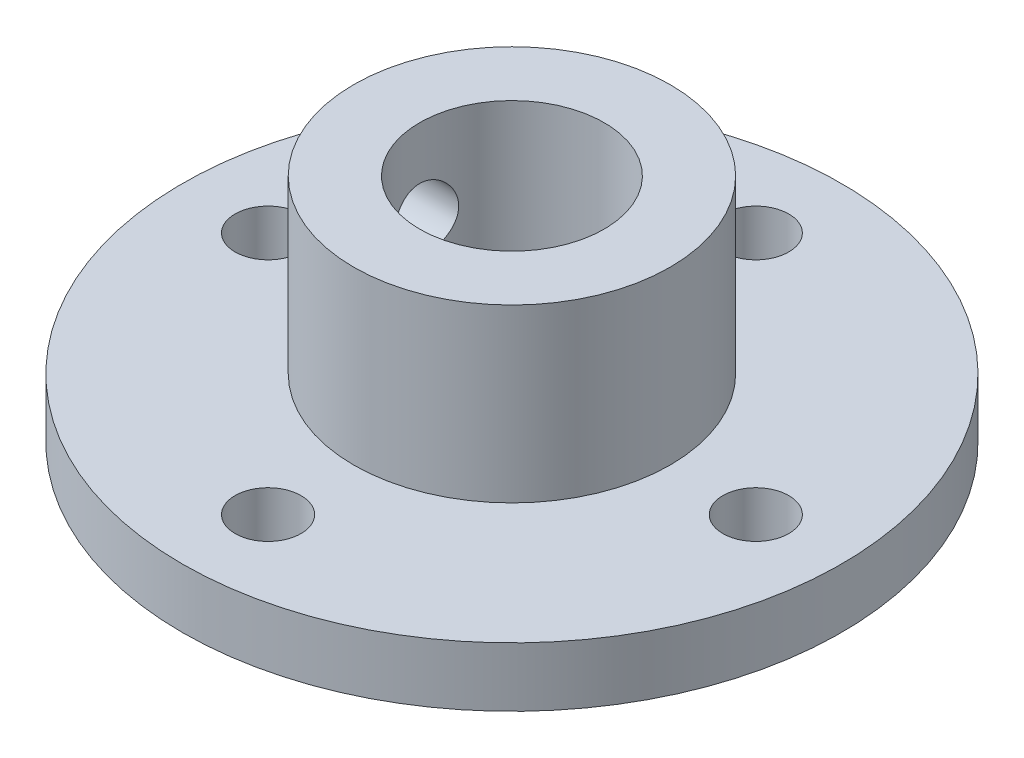
ISO-10303-21;
HEADER;
FILE_DESCRIPTION(('STEP AP214'),'2;1');
FILE_NAME('part.step','',(''),(''),'','','');
FILE_SCHEMA(('AUTOMOTIVE_DESIGN { 1 0 10303 214 1 1 1 1 }'));
ENDSEC;
DATA;
#1=APPLICATION_CONTEXT('core data for automotive mechanical design processes');
#2=APPLICATION_PROTOCOL_DEFINITION('international standard','automotive_design',2000,#1);
#3=PRODUCT_CONTEXT('',#1,'mechanical');
#4=PRODUCT('Part','Part','',(#3));
#5=PRODUCT_RELATED_PRODUCT_CATEGORY('part','',(#4));
#6=PRODUCT_DEFINITION_FORMATION('','',#4);
#7=PRODUCT_DEFINITION_CONTEXT('part definition',#1,'design');
#8=PRODUCT_DEFINITION('design','',#6,#7);
#9=PRODUCT_DEFINITION_SHAPE('','',#8);
#10=(LENGTH_UNIT() NAMED_UNIT(*) SI_UNIT(.MILLI.,.METRE.));
#11=(NAMED_UNIT(*) PLANE_ANGLE_UNIT() SI_UNIT($,.RADIAN.));
#12=(NAMED_UNIT(*) SI_UNIT($,.STERADIAN.) SOLID_ANGLE_UNIT());
#13=UNCERTAINTY_MEASURE_WITH_UNIT(LENGTH_MEASURE(1.E-05),#10,'distance_accuracy_value','');
#14=(GEOMETRIC_REPRESENTATION_CONTEXT(3) GLOBAL_UNCERTAINTY_ASSIGNED_CONTEXT((#13)) GLOBAL_UNIT_ASSIGNED_CONTEXT((#10,
#11,#12)) REPRESENTATION_CONTEXT('',''));
#15=CARTESIAN_POINT('',(0.,0.,0.));
#16=DIRECTION('',(0.,0.,1.));
#17=DIRECTION('',(1.,0.,0.));
#18=AXIS2_PLACEMENT_3D('',#15,#16,#17);
#19=CARTESIAN_POINT('',(0.,4.5,0.));
#20=DIRECTION('',(0.,-1.,0.));
#21=DIRECTION('',(0.,0.,-1.));
#22=AXIS2_PLACEMENT_3D('',#19,#20,#21);
#23=CYLINDRICAL_SURFACE('',#22,25.);
#24=CARTESIAN_POINT('',(0.,4.5,0.));
#25=DIRECTION('',(0.,1.,0.));
#26=DIRECTION('',(0.,0.,1.));
#27=AXIS2_PLACEMENT_3D('',#24,#25,#26);
#28=CIRCLE('',#27,25.);
#29=CARTESIAN_POINT('',(0.,4.5,25.));
#30=VERTEX_POINT('',#29);
#31=EDGE_CURVE('E49',#30,#30,#28,.T.);
#32=ORIENTED_EDGE('',*,*,#31,.F.);
#33=EDGE_LOOP('',(#32));
#34=FACE_BOUND('',#33,.T.);
#35=CARTESIAN_POINT('',(0.,0.,0.));
#36=DIRECTION('',(0.,1.,0.));
#37=DIRECTION('',(0.,0.,1.));
#38=AXIS2_PLACEMENT_3D('',#35,#36,#37);
#39=CIRCLE('',#38,25.);
#40=CARTESIAN_POINT('',(0.,0.,25.));
#41=VERTEX_POINT('',#40);
#42=EDGE_CURVE('E54',#41,#41,#39,.T.);
#43=ORIENTED_EDGE('',*,*,#42,.T.);
#44=EDGE_LOOP('',(#43));
#45=FACE_BOUND('',#44,.T.);
#46=ADVANCED_FACE('F37',(#34,#45),#23,.T.);
#47=CARTESIAN_POINT('',(0.,4.5,0.));
#48=DIRECTION('',(0.,1.,0.));
#49=DIRECTION('',(0.,0.,1.));
#50=AXIS2_PLACEMENT_3D('',#47,#48,#49);
#51=PLANE('',#50);
#52=CARTESIAN_POINT('',(-18.5,4.5,0.));
#53=DIRECTION('',(0.,1.,0.));
#54=DIRECTION('',(0.,0.,1.));
#55=AXIS2_PLACEMENT_3D('',#52,#53,#54);
#56=CIRCLE('',#55,2.5);
#57=CARTESIAN_POINT('',(-18.5,4.5,2.5));
#58=VERTEX_POINT('',#57);
#59=EDGE_CURVE('E91',#58,#58,#56,.T.);
#60=ORIENTED_EDGE('',*,*,#59,.F.);
#61=EDGE_LOOP('',(#60));
#62=FACE_BOUND('',#61,.T.);
#63=CARTESIAN_POINT('',(0.,4.5,-18.5));
#64=DIRECTION('',(0.,1.,0.));
#65=DIRECTION('',(0.,0.,1.));
#66=AXIS2_PLACEMENT_3D('',#63,#64,#65);
#67=CIRCLE('',#66,2.5);
#68=CARTESIAN_POINT('',(0.,4.5,-16.));
#69=VERTEX_POINT('',#68);
#70=EDGE_CURVE('E88',#69,#69,#67,.T.);
#71=ORIENTED_EDGE('',*,*,#70,.F.);
#72=EDGE_LOOP('',(#71));
#73=FACE_BOUND('',#72,.T.);
#74=CARTESIAN_POINT('',(18.5,4.5,0.));
#75=DIRECTION('',(0.,1.,0.));
#76=DIRECTION('',(0.,0.,1.));
#77=AXIS2_PLACEMENT_3D('',#74,#75,#76);
#78=CIRCLE('',#77,2.5);
#79=CARTESIAN_POINT('',(18.5,4.5,2.5));
#80=VERTEX_POINT('',#79);
#81=EDGE_CURVE('E82',#80,#80,#78,.T.);
#82=ORIENTED_EDGE('',*,*,#81,.F.);
#83=EDGE_LOOP('',(#82));
#84=FACE_BOUND('',#83,.T.);
#85=CARTESIAN_POINT('',(0.,4.5,18.5));
#86=DIRECTION('',(0.,1.,0.));
#87=DIRECTION('',(0.,0.,1.));
#88=AXIS2_PLACEMENT_3D('',#85,#86,#87);
#89=CIRCLE('',#88,2.5);
#90=CARTESIAN_POINT('',(0.,4.5,21.));
#91=VERTEX_POINT('',#90);
#92=EDGE_CURVE('E74',#91,#91,#89,.T.);
#93=ORIENTED_EDGE('',*,*,#92,.F.);
#94=EDGE_LOOP('',(#93));
#95=FACE_BOUND('',#94,.T.);
#96=CARTESIAN_POINT('',(0.,4.5,0.));
#97=DIRECTION('',(0.,1.,0.));
#98=DIRECTION('',(0.,0.,1.));
#99=AXIS2_PLACEMENT_3D('',#96,#97,#98);
#100=CIRCLE('',#99,12.);
#101=CARTESIAN_POINT('',(0.,4.5,12.));
#102=VERTEX_POINT('',#101);
#103=EDGE_CURVE('E10',#102,#102,#100,.T.);
#104=ORIENTED_EDGE('',*,*,#103,.F.);
#105=EDGE_LOOP('',(#104));
#106=FACE_BOUND('',#105,.T.);
#107=ORIENTED_EDGE('',*,*,#31,.T.);
#108=EDGE_LOOP('',(#107));
#109=FACE_BOUND('',#108,.T.);
#110=ADVANCED_FACE('F143',(#62,#73,#84,#95,#106,#109),#51,.T.);
#111=CARTESIAN_POINT('',(0.,0.,0.));
#112=DIRECTION('',(0.,1.,0.));
#113=DIRECTION('',(0.,0.,1.));
#114=AXIS2_PLACEMENT_3D('',#111,#112,#113);
#115=PLANE('',#114);
#116=CARTESIAN_POINT('',(-18.5,0.,0.));
#117=DIRECTION('',(0.,1.,0.));
#118=DIRECTION('',(0.,0.,1.));
#119=AXIS2_PLACEMENT_3D('',#116,#117,#118);
#120=CIRCLE('',#119,2.5);
#121=CARTESIAN_POINT('',(-18.5,0.,2.5));
#122=VERTEX_POINT('',#121);
#123=EDGE_CURVE('E71',#122,#122,#120,.F.);
#124=ORIENTED_EDGE('',*,*,#123,.F.);
#125=EDGE_LOOP('',(#124));
#126=FACE_BOUND('',#125,.T.);
#127=CARTESIAN_POINT('',(0.,0.,-18.5));
#128=DIRECTION('',(0.,1.,0.));
#129=DIRECTION('',(0.,0.,1.));
#130=AXIS2_PLACEMENT_3D('',#127,#128,#129);
#131=CIRCLE('',#130,2.5);
#132=CARTESIAN_POINT('',(0.,0.,-16.));
#133=VERTEX_POINT('',#132);
#134=EDGE_CURVE('E85',#133,#133,#131,.F.);
#135=ORIENTED_EDGE('',*,*,#134,.F.);
#136=EDGE_LOOP('',(#135));
#137=FACE_BOUND('',#136,.T.);
#138=CARTESIAN_POINT('',(18.5,0.,0.));
#139=DIRECTION('',(0.,1.,0.));
#140=DIRECTION('',(0.,0.,1.));
#141=AXIS2_PLACEMENT_3D('',#138,#139,#140);
#142=CIRCLE('',#141,2.5);
#143=CARTESIAN_POINT('',(18.5,0.,2.5));
#144=VERTEX_POINT('',#143);
#145=EDGE_CURVE('E77',#144,#144,#142,.F.);
#146=ORIENTED_EDGE('',*,*,#145,.F.);
#147=EDGE_LOOP('',(#146));
#148=FACE_BOUND('',#147,.T.);
#149=CARTESIAN_POINT('',(0.,0.,18.5));
#150=DIRECTION('',(0.,1.,0.));
#151=DIRECTION('',(0.,0.,1.));
#152=AXIS2_PLACEMENT_3D('',#149,#150,#151);
#153=CIRCLE('',#152,2.5);
#154=CARTESIAN_POINT('',(0.,0.,21.));
#155=VERTEX_POINT('',#154);
#156=EDGE_CURVE('E78',#155,#155,#153,.F.);
#157=ORIENTED_EDGE('',*,*,#156,.F.);
#158=EDGE_LOOP('',(#157));
#159=FACE_BOUND('',#158,.T.);
#160=CARTESIAN_POINT('',(0.,0.,0.));
#161=DIRECTION('',(0.,1.,0.));
#162=DIRECTION('',(0.,0.,1.));
#163=AXIS2_PLACEMENT_3D('',#160,#161,#162);
#164=CIRCLE('',#163,7.);
#165=CARTESIAN_POINT('',(0.,0.,7.));
#166=VERTEX_POINT('',#165);
#167=EDGE_CURVE('E63',#166,#166,#164,.F.);
#168=ORIENTED_EDGE('',*,*,#167,.F.);
#169=EDGE_LOOP('',(#168));
#170=FACE_BOUND('',#169,.T.);
#171=ORIENTED_EDGE('',*,*,#42,.F.);
#172=EDGE_LOOP('',(#171));
#173=FACE_BOUND('',#172,.T.);
#174=ADVANCED_FACE('F140',(#126,#137,#148,#159,#170,#173),#115,.F.);
#175=CARTESIAN_POINT('',(0.,17.5,0.));
#176=DIRECTION('',(0.,-1.,0.));
#177=DIRECTION('',(0.,0.,-1.));
#178=AXIS2_PLACEMENT_3D('',#175,#176,#177);
#179=CYLINDRICAL_SURFACE('',#178,12.);
#180=CARTESIAN_POINT('',(-11.7366945943055,11.,-2.5));
#181=CARTESIAN_POINT('',(-11.7366973843002,11.1387812303038,-2.499995017553));
#182=CARTESIAN_POINT('',(-11.7391829184982,11.2776239440309,-2.48840458867923));
#183=CARTESIAN_POINT('',(-11.7488403116286,11.551372634634,-2.44239298467531));
#184=CARTESIAN_POINT('',(-11.7560157627658,11.6862755110127,-2.40795430880677));
#185=CARTESIAN_POINT('',(-11.7742058592406,11.9481447456699,-2.31736795014468));
#186=CARTESIAN_POINT('',(-11.7852165141394,12.0751191919836,-2.26124282497867));
#187=CARTESIAN_POINT('',(-11.8098316267143,12.3178489992912,-2.12893977203463));
#188=CARTESIAN_POINT('',(-11.8234359795523,12.43360481346,-2.05276265471639));
#189=CARTESIAN_POINT('',(-11.8519386932295,12.6523907503069,-1.88127279893217));
#190=CARTESIAN_POINT('',(-11.8668522874608,12.7552237872529,-1.78571110973934));
#191=CARTESIAN_POINT('',(-11.8961593360515,12.9435221372962,-1.57870244776128));
#192=CARTESIAN_POINT('',(-11.9105527521983,13.0289861765829,-1.46725431091201));
#193=CARTESIAN_POINT('',(-11.937362702377,13.1808917761657,-1.23032410599918));
#194=CARTESIAN_POINT('',(-11.9497591726249,13.2471450529265,-1.10471885640989));
#195=CARTESIAN_POINT('',(-11.971006946866,13.3575321057196,-0.843857102013443));
#196=CARTESIAN_POINT('',(-11.9798586112245,13.4016681303071,-0.708601579901185));
#197=CARTESIAN_POINT('',(-11.9929117978436,13.4659515222349,-0.434325808401007));
#198=CARTESIAN_POINT('',(-11.9971778391985,13.4864320343903,-0.295386761832718));
#199=CARTESIAN_POINT('',(-12.0008022516122,13.503863391514,-0.0159836976790511));
#200=CARTESIAN_POINT('',(-12.0001611340738,13.5008166883862,0.124480159473675));
#201=CARTESIAN_POINT('',(-11.9940931618102,13.4715307980865,0.400653172399142));
#202=CARTESIAN_POINT('',(-11.9887403791317,13.4456505620838,0.536402257452949));
#203=CARTESIAN_POINT('',(-11.9739344179777,13.3720027493374,0.801587492579503));
#204=CARTESIAN_POINT('',(-11.9644810658381,13.3242342455938,0.931023375022042));
#205=CARTESIAN_POINT('',(-11.9424153464785,13.207839895749,1.18092001076937));
#206=CARTESIAN_POINT('',(-11.9297820825069,13.1390754115807,1.3013142699633));
#207=CARTESIAN_POINT('',(-11.9027460088038,12.9827439943192,1.5289869130213));
#208=CARTESIAN_POINT('',(-11.8883429791665,12.8951747235877,1.63626366363284));
#209=CARTESIAN_POINT('',(-11.8590340046655,12.7017567502179,1.83678840655382));
#210=CARTESIAN_POINT('',(-11.8441236995185,12.5955938800361,1.92973297498959));
#211=CARTESIAN_POINT('',(-11.8157374529799,12.3690359020104,2.09655194480976));
#212=CARTESIAN_POINT('',(-11.8022615435432,12.2486404772255,2.1704259213996));
#213=CARTESIAN_POINT('',(-11.7782599681831,11.9965754903424,2.29712434276908));
#214=CARTESIAN_POINT('',(-11.7677417046425,11.8648786986131,2.34989610979454));
#215=CARTESIAN_POINT('',(-11.7509521282072,11.5942167612612,2.43247155077345));
#216=CARTESIAN_POINT('',(-11.7446802101436,11.4552526543838,2.46227849764697));
#217=CARTESIAN_POINT('',(-11.7372156647826,11.1767605873622,2.49761727734035));
#218=CARTESIAN_POINT('',(-11.7359310372695,11.0372908309259,2.50358885835997));
#219=CARTESIAN_POINT('',(-11.7383390403741,10.7593483769197,2.49227386878588));
#220=CARTESIAN_POINT('',(-11.7420313630525,10.6208756181953,2.47498873715725));
#221=CARTESIAN_POINT('',(-11.7538907645233,10.3503589678838,2.41803116650967));
#222=CARTESIAN_POINT('',(-11.76201022566,10.2182626656423,2.37859682753743));
#223=CARTESIAN_POINT('',(-11.7817667700624,9.96255202111679,2.27871621721838));
#224=CARTESIAN_POINT('',(-11.7934041638211,9.8389384286992,2.21826809112293));
#225=CARTESIAN_POINT('',(-11.8190900387438,9.60178711756754,2.07709196362969));
#226=CARTESIAN_POINT('',(-11.8331701329665,9.48841559106766,1.99609065470792));
#227=CARTESIAN_POINT('',(-11.8620696798782,9.27671350168988,1.81646888113976));
#228=CARTESIAN_POINT('',(-11.8768892153306,9.17838462752154,1.71784644101035));
#229=CARTESIAN_POINT('',(-11.9058984863347,8.99787457380567,1.50380090168668));
#230=CARTESIAN_POINT('',(-11.9200734943982,8.91599180994723,1.3881238152291));
#231=CARTESIAN_POINT('',(-11.9459341754481,8.77282249582404,1.14440020443272));
#232=CARTESIAN_POINT('',(-11.9576199584164,8.7115350355251,1.01635422695376));
#233=CARTESIAN_POINT('',(-11.9771229654136,8.6117226413653,0.75228423569584));
#234=CARTESIAN_POINT('',(-11.9849632627299,8.57306166891132,0.616313421940393));
#235=CARTESIAN_POINT('',(-11.9959912282046,8.51917119198381,0.339626801006945));
#236=CARTESIAN_POINT('',(-11.9991795068579,8.50393861293454,0.198911618923386));
#237=CARTESIAN_POINT('',(-12.0005281611387,8.49746475590296,-0.0804266869406717));
#238=CARTESIAN_POINT('',(-11.9987822750957,8.5057762000105,-0.219039184355821));
#239=CARTESIAN_POINT('',(-11.99065748189,8.5451612773059,-0.492845740747128));
#240=CARTESIAN_POINT('',(-11.9842786434588,8.57623457281369,-0.62803985040549));
#241=CARTESIAN_POINT('',(-11.9676092015489,8.66005558929697,-0.890863930984022));
#242=CARTESIAN_POINT('',(-11.9573290681437,8.71274532770566,-1.01851310000874));
#243=CARTESIAN_POINT('',(-11.9339599069615,8.83824479546456,-1.2632211344418));
#244=CARTESIAN_POINT('',(-11.9208706346327,8.91105627668834,-1.38027907656019));
#245=CARTESIAN_POINT('',(-11.8930319356995,9.07621933598451,-1.60268064259534));
#246=CARTESIAN_POINT('',(-11.8782576059507,9.1688885761055,-1.70778526722739));
#247=CARTESIAN_POINT('',(-11.8488557363333,9.37048900200207,-1.90110548396524));
#248=CARTESIAN_POINT('',(-11.8342282323044,9.47942405992639,-1.98931704315914));
#249=CARTESIAN_POINT('',(-11.8065838324643,9.71201820484104,-2.14734903704121));
#250=CARTESIAN_POINT('',(-11.7935881325424,9.83583682282062,-2.21693856248136));
#251=CARTESIAN_POINT('',(-11.7709407916825,10.0936503120621,-2.3342125584477));
#252=CARTESIAN_POINT('',(-11.7612862067076,10.2276360968785,-2.381916325835));
#253=CARTESIAN_POINT('',(-11.7482800883641,10.4682125631532,-2.44513108264677));
#254=CARTESIAN_POINT('',(-11.7439632719021,10.5734590731905,-2.46566898011599));
#255=CARTESIAN_POINT('',(-11.7381695052653,10.7857915610376,-2.4931050871655));
#256=CARTESIAN_POINT('',(-11.7366924407628,10.8928774646188,-2.50000384585405));
#257=CARTESIAN_POINT('',(-11.7366945943055,11.,-2.5));
#258=B_SPLINE_CURVE_WITH_KNOTS('',3,(#180,#181,#182,#183,#184,#185,#186,#187,#188,#189,#190,
#191,#192,#193,#194,#195,#196,#197,#198,#199,#200,#201,#202,#203,#204,#205,#206,#207,#208,#209,
#210,#211,#212,#213,#214,#215,#216,#217,#218,#219,#220,#221,#222,#223,#224,#225,#226,#227,#228,
#229,#230,#231,#232,#233,#234,#235,#236,#237,#238,#239,#240,#241,#242,#243,#244,#245,#246,#247,
#248,#249,#250,#251,#252,#253,#254,#255,#256,#257),.UNSPECIFIED.,.T.,.F.,(4,2,2,2,2,2,2,2,2,2,2,
2,2,2,2,2,2,2,2,2,2,2,2,2,2,2,2,2,2,2,2,2,2,2,2,2,2,2,4),(0.,0.415951308142539,
0.832221584834942,1.24806002960546,1.66388166963158,2.0854266693577,2.50700257327748,
2.93258052533688,3.35811520213866,3.77758097718529,4.19700303792678,4.60994682832922,
5.02290810911741,5.43865743955899,5.8544584820852,6.27811724489827,6.70178544383256,
7.12650474664976,7.55116350775194,7.96795032019585,8.38471134593049,8.79707572463846,
9.20947650928062,9.62767835869302,10.0459271216437,10.4711891750669,10.8964324351808,
11.3190919929707,11.7416960791916,12.1563258784529,12.5709495266596,12.984468211702,
13.3980229105635,13.8187663795715,14.2396101685507,14.6654530271772,15.0909196914727,
15.4119973517483,15.7330620852562),.UNSPECIFIED.);
#259=CARTESIAN_POINT('',(-11.7366945943055,11.,-2.5));
#260=VERTEX_POINT('',#259);
#261=EDGE_CURVE('E81',#260,#260,#258,.T.);
#262=ORIENTED_EDGE('',*,*,#261,.T.);
#263=EDGE_LOOP('',(#262));
#264=FACE_BOUND('',#263,.T.);
#265=CARTESIAN_POINT('',(0.,17.5,0.));
#266=DIRECTION('',(0.,1.,0.));
#267=DIRECTION('',(0.,0.,1.));
#268=AXIS2_PLACEMENT_3D('',#265,#266,#267);
#269=CIRCLE('',#268,12.);
#270=CARTESIAN_POINT('',(0.,17.5,12.));
#271=VERTEX_POINT('',#270);
#272=EDGE_CURVE('E57',#271,#271,#269,.T.);
#273=ORIENTED_EDGE('',*,*,#272,.F.);
#274=EDGE_LOOP('',(#273));
#275=FACE_BOUND('',#274,.T.);
#276=ORIENTED_EDGE('',*,*,#103,.T.);
#277=EDGE_LOOP('',(#276));
#278=FACE_BOUND('',#277,.T.);
#279=ADVANCED_FACE('F103',(#264,#275,#278),#179,.T.);
#280=CARTESIAN_POINT('',(0.,17.5,0.));
#281=DIRECTION('',(0.,1.,0.));
#282=DIRECTION('',(0.,0.,1.));
#283=AXIS2_PLACEMENT_3D('',#280,#281,#282);
#284=PLANE('',#283);
#285=CARTESIAN_POINT('',(0.,17.5,0.));
#286=DIRECTION('',(0.,1.,0.));
#287=DIRECTION('',(0.,0.,1.));
#288=AXIS2_PLACEMENT_3D('',#285,#286,#287);
#289=CIRCLE('',#288,7.);
#290=CARTESIAN_POINT('',(0.,17.5,7.));
#291=VERTEX_POINT('',#290);
#292=EDGE_CURVE('E67',#291,#291,#289,.T.);
#293=ORIENTED_EDGE('',*,*,#292,.F.);
#294=EDGE_LOOP('',(#293));
#295=FACE_BOUND('',#294,.T.);
#296=ORIENTED_EDGE('',*,*,#272,.T.);
#297=EDGE_LOOP('',(#296));
#298=FACE_BOUND('',#297,.T.);
#299=ADVANCED_FACE('F131',(#295,#298),#284,.T.);
#300=CARTESIAN_POINT('',(0.,-19.7989898732233,0.));
#301=DIRECTION('',(0.,1.,0.));
#302=DIRECTION('',(0.,0.,1.));
#303=AXIS2_PLACEMENT_3D('',#300,#301,#302);
#304=CYLINDRICAL_SURFACE('',#303,7.);
#305=CARTESIAN_POINT('',(-6.53834841531101,11.,-2.5));
#306=CARTESIAN_POINT('',(-6.53834584824662,10.8644729375943,-2.50000293142537));
#307=CARTESIAN_POINT('',(-6.54260813914497,10.7289661363285,-2.48894249442903));
#308=CARTESIAN_POINT('',(-6.55909115270696,10.4620070809665,-2.44517096849285));
#309=CARTESIAN_POINT('',(-6.57131226844033,10.3305550274615,-2.41245881021845));
#310=CARTESIAN_POINT('',(-6.60215581723148,10.0756252409608,-2.32671186637106));
#311=CARTESIAN_POINT('',(-6.62076416275494,9.95213066315779,-2.27372177606199));
#312=CARTESIAN_POINT('',(-6.66226377845015,9.71573913120065,-2.14907922668042));
#313=CARTESIAN_POINT('',(-6.68515619613769,9.60284502864645,-2.07742176541371));
#314=CARTESIAN_POINT('',(-6.73379932254782,9.38577880109018,-1.91402447589221));
#315=CARTESIAN_POINT('',(-6.75962863426194,9.28215213793684,-1.82158324114035));
#316=CARTESIAN_POINT('',(-6.81057580348321,9.09149315131819,-1.62073451198084));
#317=CARTESIAN_POINT('',(-6.8356935259156,9.00446396067198,-1.51232401016048));
#318=CARTESIAN_POINT('',(-6.88331097797524,8.84691091314746,-1.27854087761788));
#319=CARTESIAN_POINT('',(-6.90570766813103,8.77697050756981,-1.15275218770255));
#320=CARTESIAN_POINT('',(-6.94442306763787,8.65946494454605,-0.890255063415838));
#321=CARTESIAN_POINT('',(-6.9607436747499,8.61189279953219,-0.753550054799068));
#322=CARTESIAN_POINT('',(-6.98491061598651,8.54235905119993,-0.478828726649306));
#323=CARTESIAN_POINT('',(-6.99306609346167,8.51946043976448,-0.341077285205312));
#324=CARTESIAN_POINT('',(-7.00108797904843,8.4969316101723,-0.0634617212480552));
#325=CARTESIAN_POINT('',(-7.0009568336799,8.49729452434681,0.0764017655189433));
#326=CARTESIAN_POINT('',(-6.99262260766838,8.5207111975646,0.347592373494539));
#327=CARTESIAN_POINT('',(-6.98478254135507,8.54274450638211,0.479020651818554));
#328=CARTESIAN_POINT('',(-6.96237851891869,8.6071728511432,0.736174131701904));
#329=CARTESIAN_POINT('',(-6.94781409330092,8.64956930884994,0.861898934371371));
#330=CARTESIAN_POINT('',(-6.91316507785892,8.75404691582561,1.10616096680958));
#331=CARTESIAN_POINT('',(-6.89300594264802,8.81639576699443,1.22457268185839));
#332=CARTESIAN_POINT('',(-6.84923357904069,8.9587791400987,1.44953519587013));
#333=CARTESIAN_POINT('',(-6.82561929883884,9.03881905129852,1.55608236560633));
#334=CARTESIAN_POINT('',(-6.77590353640076,9.21933077593155,1.76033248031897));
#335=CARTESIAN_POINT('',(-6.74973657984375,9.32066690193269,1.85725678265592));
#336=CARTESIAN_POINT('',(-6.69889962393309,9.53834348743058,2.03301110882291));
#337=CARTESIAN_POINT('',(-6.67422993264586,9.65468701945542,2.11183741816384));
#338=CARTESIAN_POINT('',(-6.62879124339515,9.90187765191961,2.25045901136819));
#339=CARTESIAN_POINT('',(-6.6081027649338,10.0329530664133,2.30987563749326));
#340=CARTESIAN_POINT('',(-6.57389739465232,10.304179451939,2.40551106572703));
#341=CARTESIAN_POINT('',(-6.56037695532894,10.4443258950592,2.44174134473282));
#342=CARTESIAN_POINT('',(-6.54286005574888,10.7220838857687,2.48828716066845));
#343=CARTESIAN_POINT('',(-6.53841416370465,10.859461812678,2.49982704691603));
#344=CARTESIAN_POINT('',(-6.53828418658321,11.1342333752167,2.50016897842258));
#345=CARTESIAN_POINT('',(-6.54259819175289,11.2716270008938,2.48897597969827));
#346=CARTESIAN_POINT('',(-6.55904904907211,11.5365737747273,2.44527599545485));
#347=CARTESIAN_POINT('',(-6.57085417549385,11.6642987435769,2.41367185988826));
#348=CARTESIAN_POINT('',(-6.60057618928644,11.9125899149936,2.33115923950033));
#349=CARTESIAN_POINT('',(-6.6184942567719,12.0331547299992,2.2802470270069));
#350=CARTESIAN_POINT('',(-6.65919897877472,12.2684001774881,2.15854403482729));
#351=CARTESIAN_POINT('',(-6.68213439822037,12.3827259257826,2.08711845508965));
#352=CARTESIAN_POINT('',(-6.73002297450369,12.598207720803,1.92711056207351));
#353=CARTESIAN_POINT('',(-6.75497680677526,12.6993593291826,1.83852249165407));
#354=CARTESIAN_POINT('',(-6.80579566439709,12.8915426899962,1.64077043500406));
#355=CARTESIAN_POINT('',(-6.83163247928111,12.9816793854627,1.53072651663186));
#356=CARTESIAN_POINT('',(-6.87993729369829,13.1422926850507,1.29643714363478));
#357=CARTESIAN_POINT('',(-6.90240534953732,13.2127696177849,1.17219192643341));
#358=CARTESIAN_POINT('',(-6.94137984159745,13.3315002234082,0.91338047392643));
#359=CARTESIAN_POINT('',(-6.95791626179403,13.3798660174607,0.778870439322978));
#360=CARTESIAN_POINT('',(-6.9832833598311,13.4530468590572,0.502906898921741));
#361=CARTESIAN_POINT('',(-6.99211728252105,13.4778718240885,0.361456343526465));
#362=CARTESIAN_POINT('',(-7.0008038188261,13.5022729666443,0.0837575092861365));
#363=CARTESIAN_POINT('',(-7.00111065426498,13.5031261064489,-0.0523654499558731));
#364=CARTESIAN_POINT('',(-6.99386365091442,13.4827846230133,-0.322726803691473));
#365=CARTESIAN_POINT('',(-6.98631061639184,13.4615922555955,-0.456965389580549));
#366=CARTESIAN_POINT('',(-6.96438311073992,13.3986398707044,-0.716981322330597));
#367=CARTESIAN_POINT('',(-6.95015128080456,13.3573092766315,-0.842875555999297));
#368=CARTESIAN_POINT('',(-6.91633887698632,13.2556669092691,-1.08597143426168));
#369=CARTESIAN_POINT('',(-6.8967573009467,13.1953515792864,-1.20317144494909));
#370=CARTESIAN_POINT('',(-6.85325490485467,13.0546886476762,-1.43068233807408));
#371=CARTESIAN_POINT('',(-6.82919171160486,12.9736355249015,-1.54052934900393));
#372=CARTESIAN_POINT('',(-6.77971046047431,12.7949475408083,-1.74546847276757));
#373=CARTESIAN_POINT('',(-6.75429194159098,12.6973070124168,-1.84055552155398));
#374=CARTESIAN_POINT('',(-6.70352883842234,12.4827811728258,-2.01782220864538));
#375=CARTESIAN_POINT('',(-6.67824313001613,12.3652101225806,-2.09919180205207));
#376=CARTESIAN_POINT('',(-6.63200351602705,12.1172615856897,-2.24100798811166));
#377=CARTESIAN_POINT('',(-6.61104931825108,11.9868849637522,-2.30145599226941));
#378=CARTESIAN_POINT('',(-6.57609213229057,11.7162590761611,-2.39953333207332));
#379=CARTESIAN_POINT('',(-6.56211826403834,11.5759711936215,-2.43706721874483));
#380=CARTESIAN_POINT('',(-6.54325005921779,11.2904461064685,-2.48729274825372));
#381=CARTESIAN_POINT('',(-6.53835116581018,11.1452114231358,-2.4999968591037));
#382=CARTESIAN_POINT('',(-6.53834841531101,11.,-2.5));
#383=B_SPLINE_CURVE_WITH_KNOTS('',3,(#305,#306,#307,#308,#309,#310,#311,#312,#313,#314,#315,
#316,#317,#318,#319,#320,#321,#322,#323,#324,#325,#326,#327,#328,#329,#330,#331,#332,#333,#334,
#335,#336,#337,#338,#339,#340,#341,#342,#343,#344,#345,#346,#347,#348,#349,#350,#351,#352,#353,
#354,#355,#356,#357,#358,#359,#360,#361,#362,#363,#364,#365,#366,#367,#368,#369,#370,#371,#372,
#373,#374,#375,#376,#377,#378,#379,#380,#381,#382),.UNSPECIFIED.,.T.,.F.,(4,2,2,2,2,2,2,2,2,2,2,
2,2,2,2,2,2,2,2,2,2,2,2,2,2,2,2,2,2,2,2,2,2,2,2,2,2,2,4),(0.,0.406041766331001,
0.812103587736961,1.21727550243125,1.62255610072681,2.04441002530116,2.46634349733964,
2.90112813694272,3.33577686482073,3.75326460234542,4.17062908250815,4.56923737347846,
4.96787349948484,5.37209971069683,5.77644923231493,6.20244167773848,6.62852147719004,
7.06247609308417,7.4962157414176,7.90789453596191,8.31948358967585,8.71400941843617,
9.10861145427952,9.5170588594572,9.92564351590594,10.3573204832378,10.7889902346611,
11.2184461110406,11.6477209819893,12.0540827015585,12.4604028439597,12.8584146445103,
13.2565010549614,13.67053016118,14.0847010056159,14.5182116217954,14.9516929848591,
15.386967912939,15.8220242160484),.UNSPECIFIED.);
#384=CARTESIAN_POINT('',(-6.53834841531101,11.,-2.5));
#385=VERTEX_POINT('',#384);
#386=EDGE_CURVE('E40',#385,#385,#383,.T.);
#387=ORIENTED_EDGE('',*,*,#386,.T.);
#388=EDGE_LOOP('',(#387));
#389=FACE_BOUND('',#388,.T.);
#390=ORIENTED_EDGE('',*,*,#167,.T.);
#391=EDGE_LOOP('',(#390));
#392=FACE_BOUND('',#391,.T.);
#393=ORIENTED_EDGE('',*,*,#292,.T.);
#394=EDGE_LOOP('',(#393));
#395=FACE_BOUND('',#394,.T.);
#396=ADVANCED_FACE('F127',(#389,#392,#395),#304,.F.);
#397=CARTESIAN_POINT('',(0.,-7.07106781186547,18.5));
#398=DIRECTION('',(0.,1.,0.));
#399=DIRECTION('',(0.,0.,1.));
#400=AXIS2_PLACEMENT_3D('',#397,#398,#399);
#401=CYLINDRICAL_SURFACE('',#400,2.5);
#402=ORIENTED_EDGE('',*,*,#156,.T.);
#403=EDGE_LOOP('',(#402));
#404=FACE_BOUND('',#403,.T.);
#405=ORIENTED_EDGE('',*,*,#92,.T.);
#406=EDGE_LOOP('',(#405));
#407=FACE_BOUND('',#406,.T.);
#408=ADVANCED_FACE('F124',(#404,#407),#401,.F.);
#409=CARTESIAN_POINT('',(18.5,-7.07106781186547,0.));
#410=DIRECTION('',(0.,1.,0.));
#411=DIRECTION('',(0.,0.,1.));
#412=AXIS2_PLACEMENT_3D('',#409,#410,#411);
#413=CYLINDRICAL_SURFACE('',#412,2.5);
#414=ORIENTED_EDGE('',*,*,#145,.T.);
#415=EDGE_LOOP('',(#414));
#416=FACE_BOUND('',#415,.T.);
#417=ORIENTED_EDGE('',*,*,#81,.T.);
#418=EDGE_LOOP('',(#417));
#419=FACE_BOUND('',#418,.T.);
#420=ADVANCED_FACE('F120',(#416,#419),#413,.F.);
#421=CARTESIAN_POINT('',(0.,-7.07106781186547,-18.5));
#422=DIRECTION('',(0.,1.,0.));
#423=DIRECTION('',(0.,0.,1.));
#424=AXIS2_PLACEMENT_3D('',#421,#422,#423);
#425=CYLINDRICAL_SURFACE('',#424,2.5);
#426=ORIENTED_EDGE('',*,*,#134,.T.);
#427=EDGE_LOOP('',(#426));
#428=FACE_BOUND('',#427,.T.);
#429=ORIENTED_EDGE('',*,*,#70,.T.);
#430=EDGE_LOOP('',(#429));
#431=FACE_BOUND('',#430,.T.);
#432=ADVANCED_FACE('F116',(#428,#431),#425,.F.);
#433=CARTESIAN_POINT('',(-18.5,-7.07106781186547,0.));
#434=DIRECTION('',(0.,1.,0.));
#435=DIRECTION('',(0.,0.,1.));
#436=AXIS2_PLACEMENT_3D('',#433,#434,#435);
#437=CYLINDRICAL_SURFACE('',#436,2.5);
#438=ORIENTED_EDGE('',*,*,#123,.T.);
#439=EDGE_LOOP('',(#438));
#440=FACE_BOUND('',#439,.T.);
#441=ORIENTED_EDGE('',*,*,#59,.T.);
#442=EDGE_LOOP('',(#441));
#443=FACE_BOUND('',#442,.T.);
#444=ADVANCED_FACE('F111',(#440,#443),#437,.F.);
#445=CARTESIAN_POINT('',(-25.,11.,0.));
#446=DIRECTION('',(1.,0.,0.));
#447=DIRECTION('',(0.,0.,-1.));
#448=AXIS2_PLACEMENT_3D('',#445,#446,#447);
#449=CYLINDRICAL_SURFACE('',#448,2.5);
#450=ORIENTED_EDGE('',*,*,#386,.F.);
#451=EDGE_LOOP('',(#450));
#452=FACE_BOUND('',#451,.T.);
#453=ORIENTED_EDGE('',*,*,#261,.F.);
#454=EDGE_LOOP('',(#453));
#455=FACE_BOUND('',#454,.T.);
#456=ADVANCED_FACE('F107',(#452,#455),#449,.F.);
#457=CLOSED_SHELL('',(#46,#110,#174,#279,#299,#396,#408,#420,#432,#444,#456));
#458=MANIFOLD_SOLID_BREP('B2',#457);
#459=ADVANCED_BREP_SHAPE_REPRESENTATION('',(#18,#458),#14);
#460=SHAPE_DEFINITION_REPRESENTATION(#9,#459);
ENDSEC;
END-ISO-10303-21;
